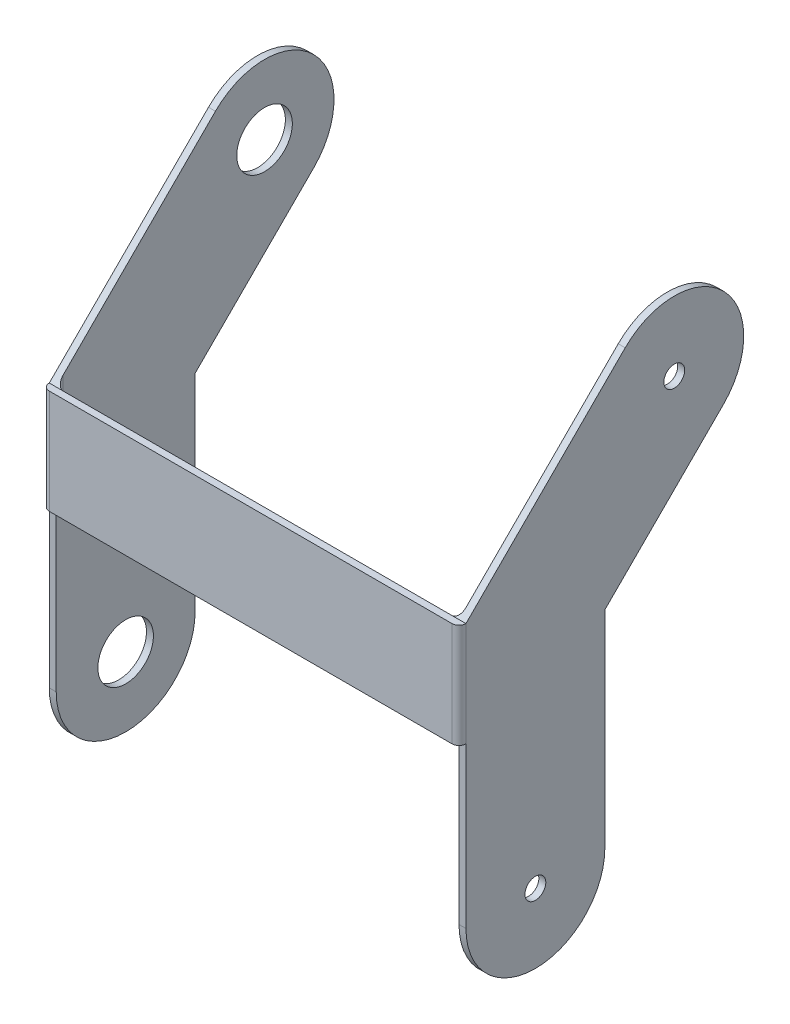
ISO-10303-21;
HEADER;
FILE_DESCRIPTION(('STEP AP214'),'2;1');
FILE_NAME('part.step','',(''),(''),'','','');
FILE_SCHEMA(('AUTOMOTIVE_DESIGN { 1 0 10303 214 1 1 1 1 }'));
ENDSEC;
DATA;
#1=APPLICATION_CONTEXT('core data for automotive mechanical design processes');
#2=APPLICATION_PROTOCOL_DEFINITION('international standard','automotive_design',2000,#1);
#3=PRODUCT_CONTEXT('',#1,'mechanical');
#4=PRODUCT('Part','Part','',(#3));
#5=PRODUCT_RELATED_PRODUCT_CATEGORY('part','',(#4));
#6=PRODUCT_DEFINITION_FORMATION('','',#4);
#7=PRODUCT_DEFINITION_CONTEXT('part definition',#1,'design');
#8=PRODUCT_DEFINITION('design','',#6,#7);
#9=PRODUCT_DEFINITION_SHAPE('','',#8);
#10=(LENGTH_UNIT() NAMED_UNIT(*) SI_UNIT(.MILLI.,.METRE.));
#11=(NAMED_UNIT(*) PLANE_ANGLE_UNIT() SI_UNIT($,.RADIAN.));
#12=(NAMED_UNIT(*) SI_UNIT($,.STERADIAN.) SOLID_ANGLE_UNIT());
#13=UNCERTAINTY_MEASURE_WITH_UNIT(LENGTH_MEASURE(1.E-05),#10,'distance_accuracy_value','');
#14=(GEOMETRIC_REPRESENTATION_CONTEXT(3) GLOBAL_UNCERTAINTY_ASSIGNED_CONTEXT((#13)) GLOBAL_UNIT_ASSIGNED_CONTEXT((#10,
#11,#12)) REPRESENTATION_CONTEXT('',''));
#15=CARTESIAN_POINT('',(0.,0.,0.));
#16=DIRECTION('',(0.,0.,1.));
#17=DIRECTION('',(1.,0.,0.));
#18=AXIS2_PLACEMENT_3D('',#15,#16,#17);
#19=CARTESIAN_POINT('',(1.,-38.019,0.));
#20=DIRECTION('',(0.,0.,-1.));
#21=DIRECTION('',(-1.,0.,0.));
#22=AXIS2_PLACEMENT_3D('',#19,#20,#21);
#23=PLANE('',#22);
#24=DIRECTION('',(-1.,0.,0.));
#25=VECTOR('',#24,1.);
#26=CARTESIAN_POINT('',(30.,-15.,0.));
#27=LINE('',#26,#25);
#28=CARTESIAN_POINT('',(1.,-15.,0.));
#29=VERTEX_POINT('',#28);
#30=CARTESIAN_POINT('',(0.,-15.,0.));
#31=VERTEX_POINT('',#30);
#32=EDGE_CURVE('E165',#29,#31,#27,.T.);
#33=ORIENTED_EDGE('',*,*,#32,.T.);
#34=DIRECTION('',(0.,-1.,0.));
#35=VECTOR('',#34,1.);
#36=CARTESIAN_POINT('',(0.,-38.019,0.));
#37=LINE('',#36,#35);
#38=CARTESIAN_POINT('',(0.,-38.019,0.));
#39=VERTEX_POINT('',#38);
#40=EDGE_CURVE('E176',#31,#39,#37,.T.);
#41=ORIENTED_EDGE('',*,*,#40,.T.);
#42=DIRECTION('',(-1.,0.,0.));
#43=VECTOR('',#42,1.);
#44=CARTESIAN_POINT('',(1.,-38.019,0.));
#45=LINE('',#44,#43);
#46=CARTESIAN_POINT('',(1.,-38.019,0.));
#47=VERTEX_POINT('',#46);
#48=EDGE_CURVE('E235',#47,#39,#45,.T.);
#49=ORIENTED_EDGE('',*,*,#48,.F.);
#50=DIRECTION('',(0.,-1.,0.));
#51=VECTOR('',#50,1.);
#52=CARTESIAN_POINT('',(1.,-38.019,0.));
#53=LINE('',#52,#51);
#54=EDGE_CURVE('E179',#29,#47,#53,.T.);
#55=ORIENTED_EDGE('',*,*,#54,.F.);
#56=EDGE_LOOP('',(#33,#41,#49,#55));
#57=FACE_BOUND('',#56,.T.);
#58=ADVANCED_FACE('F32',(#57),#23,.F.);
#59=CARTESIAN_POINT('',(1.,15.8575766748895,-29.9997122986205));
#60=DIRECTION('',(-1.,0.,0.));
#61=DIRECTION('',(0.,0.,1.));
#62=AXIS2_PLACEMENT_3D('',#59,#60,#61);
#63=PLANE('',#62);
#64=CARTESIAN_POINT('',(1.,-38.019,-10.));
#65=DIRECTION('',(-1.,0.,0.));
#66=DIRECTION('',(0.,0.,1.));
#67=AXIS2_PLACEMENT_3D('',#64,#65,#66);
#68=CIRCLE('',#67,4.);
#69=CARTESIAN_POINT('',(1.,-38.019,-6.));
#70=VERTEX_POINT('',#69);
#71=EDGE_CURVE('E346',#70,#70,#68,.F.);
#72=ORIENTED_EDGE('',*,*,#71,.F.);
#73=EDGE_LOOP('',(#72));
#74=FACE_BOUND('',#73,.T.);
#75=CARTESIAN_POINT('',(1.,15.8575766748895,-29.9997122986205));
#76=DIRECTION('',(-1.,0.,0.));
#77=DIRECTION('',(0.,0.,1.));
#78=AXIS2_PLACEMENT_3D('',#75,#76,#77);
#79=CIRCLE('',#78,4.);
#80=CARTESIAN_POINT('',(1.,15.8575766748895,-25.9997122986205));
#81=VERTEX_POINT('',#80);
#82=EDGE_CURVE('E340',#81,#81,#79,.F.);
#83=ORIENTED_EDGE('',*,*,#82,.F.);
#84=EDGE_LOOP('',(#83));
#85=FACE_BOUND('',#84,.T.);
#86=DIRECTION('',(0.,-0.707106781186546,0.707106781186549));
#87=VECTOR('',#86,1.);
#88=CARTESIAN_POINT('',(1.,0.,0.));
#89=LINE('',#88,#87);
#90=CARTESIAN_POINT('',(1.,22.928644486755,-22.928644486755));
#91=VERTEX_POINT('',#90);
#92=CARTESIAN_POINT('',(1.,0.999999999999997,-0.999999999999999));
#93=VERTEX_POINT('',#92);
#94=EDGE_CURVE('E240',#91,#93,#89,.T.);
#95=ORIENTED_EDGE('',*,*,#94,.T.);
#96=DIRECTION('',(0.,-1.,0.));
#97=VECTOR('',#96,1.);
#98=CARTESIAN_POINT('',(1.,-15.,-1.));
#99=LINE('',#98,#97);
#100=CARTESIAN_POINT('',(1.,-15.,-1.));
#101=VERTEX_POINT('',#100);
#102=EDGE_CURVE('E232',#93,#101,#99,.T.);
#103=ORIENTED_EDGE('',*,*,#102,.T.);
#104=DIRECTION('',(0.,0.,1.));
#105=VECTOR('',#104,1.);
#106=CARTESIAN_POINT('',(1.,-15.,0.));
#107=LINE('',#106,#105);
#108=EDGE_CURVE('E233',#101,#29,#107,.T.);
#109=ORIENTED_EDGE('',*,*,#108,.T.);
#110=ORIENTED_EDGE('',*,*,#54,.T.);
#111=CARTESIAN_POINT('',(1.,-38.019,-10.));
#112=DIRECTION('',(1.,0.,0.));
#113=DIRECTION('',(0.,0.,1.));
#114=AXIS2_PLACEMENT_3D('',#111,#112,#113);
#115=CIRCLE('',#114,10.);
#116=CARTESIAN_POINT('',(1.,-38.019,-20.));
#117=VERTEX_POINT('',#116);
#118=EDGE_CURVE('E273',#47,#117,#115,.T.);
#119=ORIENTED_EDGE('',*,*,#118,.T.);
#120=DIRECTION('',(0.,1.,0.));
#121=VECTOR('',#120,1.);
#122=CARTESIAN_POINT('',(1.,-8.28427124746194,-20.));
#123=LINE('',#122,#121);
#124=CARTESIAN_POINT('',(1.,-8.28427124746194,-20.));
#125=VERTEX_POINT('',#124);
#126=EDGE_CURVE('E271',#117,#125,#123,.T.);
#127=ORIENTED_EDGE('',*,*,#126,.T.);
#128=DIRECTION('',(0.,0.707106781186546,-0.707106781186549));
#129=VECTOR('',#128,1.);
#130=CARTESIAN_POINT('',(1.,8.78650886302398,-37.070780110486));
#131=LINE('',#130,#129);
#132=CARTESIAN_POINT('',(1.,8.78650886302399,-37.070780110486));
#133=VERTEX_POINT('',#132);
#134=EDGE_CURVE('E269',#125,#133,#131,.T.);
#135=ORIENTED_EDGE('',*,*,#134,.T.);
#136=CARTESIAN_POINT('',(1.,15.8575766748895,-29.9997122986205));
#137=DIRECTION('',(1.,0.,0.));
#138=DIRECTION('',(0.,0.,1.));
#139=AXIS2_PLACEMENT_3D('',#136,#137,#138);
#140=CIRCLE('',#139,10.);
#141=EDGE_CURVE('E267',#133,#91,#140,.T.);
#142=ORIENTED_EDGE('',*,*,#141,.T.);
#143=EDGE_LOOP('',(#95,#103,#109,#110,#119,#127,#135,#142));
#144=FACE_BOUND('',#143,.T.);
#145=ADVANCED_FACE('F238',(#74,#85,#144),#63,.F.);
#146=CARTESIAN_POINT('',(0.,15.8575766748895,-29.9997122986205));
#147=DIRECTION('',(-1.,0.,0.));
#148=DIRECTION('',(0.,0.,1.));
#149=AXIS2_PLACEMENT_3D('',#146,#147,#148);
#150=PLANE('',#149);
#151=CARTESIAN_POINT('',(0.,-38.019,-10.));
#152=DIRECTION('',(-1.,0.,0.));
#153=DIRECTION('',(0.,0.,1.));
#154=AXIS2_PLACEMENT_3D('',#151,#152,#153);
#155=CIRCLE('',#154,4.);
#156=CARTESIAN_POINT('',(0.,-38.019,-6.));
#157=VERTEX_POINT('',#156);
#158=EDGE_CURVE('E349',#157,#157,#155,.T.);
#159=ORIENTED_EDGE('',*,*,#158,.F.);
#160=EDGE_LOOP('',(#159));
#161=FACE_BOUND('',#160,.T.);
#162=CARTESIAN_POINT('',(0.,15.8575766748895,-29.9997122986205));
#163=DIRECTION('',(-1.,0.,0.));
#164=DIRECTION('',(0.,0.,1.));
#165=AXIS2_PLACEMENT_3D('',#162,#163,#164);
#166=CIRCLE('',#165,4.);
#167=CARTESIAN_POINT('',(0.,15.8575766748895,-25.9997122986205));
#168=VERTEX_POINT('',#167);
#169=EDGE_CURVE('E343',#168,#168,#166,.T.);
#170=ORIENTED_EDGE('',*,*,#169,.F.);
#171=EDGE_LOOP('',(#170));
#172=FACE_BOUND('',#171,.T.);
#173=ORIENTED_EDGE('',*,*,#40,.F.);
#174=DIRECTION('',(0.,-1.,0.));
#175=VECTOR('',#174,1.);
#176=CARTESIAN_POINT('',(0.,0.,0.));
#177=LINE('',#176,#175);
#178=CARTESIAN_POINT('',(0.,0.,0.));
#179=VERTEX_POINT('',#178);
#180=EDGE_CURVE('E122',#31,#179,#177,.F.);
#181=ORIENTED_EDGE('',*,*,#180,.T.);
#182=DIRECTION('',(0.,-0.707106781186546,0.707106781186549));
#183=VECTOR('',#182,1.);
#184=CARTESIAN_POINT('',(0.,0.,0.));
#185=LINE('',#184,#183);
#186=CARTESIAN_POINT('',(0.,22.928644486755,-22.928644486755));
#187=VERTEX_POINT('',#186);
#188=EDGE_CURVE('E257',#187,#179,#185,.T.);
#189=ORIENTED_EDGE('',*,*,#188,.F.);
#190=CARTESIAN_POINT('',(0.,15.8575766748895,-29.9997122986205));
#191=DIRECTION('',(1.,0.,0.));
#192=DIRECTION('',(0.,0.,1.));
#193=AXIS2_PLACEMENT_3D('',#190,#191,#192);
#194=CIRCLE('',#193,10.);
#195=CARTESIAN_POINT('',(0.,8.78650886302399,-37.070780110486));
#196=VERTEX_POINT('',#195);
#197=EDGE_CURVE('E259',#196,#187,#194,.T.);
#198=ORIENTED_EDGE('',*,*,#197,.F.);
#199=DIRECTION('',(0.,0.707106781186546,-0.707106781186549));
#200=VECTOR('',#199,1.);
#201=CARTESIAN_POINT('',(0.,8.78650886302398,-37.070780110486));
#202=LINE('',#201,#200);
#203=CARTESIAN_POINT('',(0.,-8.28427124746194,-20.));
#204=VERTEX_POINT('',#203);
#205=EDGE_CURVE('E261',#204,#196,#202,.T.);
#206=ORIENTED_EDGE('',*,*,#205,.F.);
#207=DIRECTION('',(0.,1.,0.));
#208=VECTOR('',#207,1.);
#209=CARTESIAN_POINT('',(0.,-8.28427124746194,-20.));
#210=LINE('',#209,#208);
#211=CARTESIAN_POINT('',(0.,-38.019,-20.));
#212=VERTEX_POINT('',#211);
#213=EDGE_CURVE('E263',#212,#204,#210,.T.);
#214=ORIENTED_EDGE('',*,*,#213,.F.);
#215=CARTESIAN_POINT('',(0.,-38.019,-10.));
#216=DIRECTION('',(1.,0.,0.));
#217=DIRECTION('',(0.,0.,1.));
#218=AXIS2_PLACEMENT_3D('',#215,#216,#217);
#219=CIRCLE('',#218,10.);
#220=EDGE_CURVE('E188',#39,#212,#219,.T.);
#221=ORIENTED_EDGE('',*,*,#220,.F.);
#222=EDGE_LOOP('',(#173,#181,#189,#198,#206,#214,#221));
#223=FACE_BOUND('',#222,.T.);
#224=ADVANCED_FACE('F183',(#161,#172,#223),#150,.T.);
#225=CARTESIAN_POINT('',(1.,-38.019,-10.));
#226=DIRECTION('',(-1.,0.,0.));
#227=DIRECTION('',(0.,0.,1.));
#228=AXIS2_PLACEMENT_3D('',#225,#226,#227);
#229=CYLINDRICAL_SURFACE('',#228,10.);
#230=ORIENTED_EDGE('',*,*,#220,.T.);
#231=DIRECTION('',(-1.,0.,0.));
#232=VECTOR('',#231,1.);
#233=CARTESIAN_POINT('',(1.,-38.019,-20.));
#234=LINE('',#233,#232);
#235=EDGE_CURVE('E244',#117,#212,#234,.T.);
#236=ORIENTED_EDGE('',*,*,#235,.F.);
#237=ORIENTED_EDGE('',*,*,#118,.F.);
#238=ORIENTED_EDGE('',*,*,#48,.T.);
#239=EDGE_LOOP('',(#230,#236,#237,#238));
#240=FACE_BOUND('',#239,.T.);
#241=ADVANCED_FACE('F358',(#240),#229,.T.);
#242=CARTESIAN_POINT('',(1.,-8.28427124746194,-20.));
#243=DIRECTION('',(0.,0.,1.));
#244=DIRECTION('',(1.,0.,0.));
#245=AXIS2_PLACEMENT_3D('',#242,#243,#244);
#246=PLANE('',#245);
#247=ORIENTED_EDGE('',*,*,#213,.T.);
#248=DIRECTION('',(-1.,0.,0.));
#249=VECTOR('',#248,1.);
#250=CARTESIAN_POINT('',(1.,-8.28427124746194,-20.));
#251=LINE('',#250,#249);
#252=EDGE_CURVE('E247',#125,#204,#251,.T.);
#253=ORIENTED_EDGE('',*,*,#252,.F.);
#254=ORIENTED_EDGE('',*,*,#126,.F.);
#255=ORIENTED_EDGE('',*,*,#235,.T.);
#256=EDGE_LOOP('',(#247,#253,#254,#255));
#257=FACE_BOUND('',#256,.T.);
#258=ADVANCED_FACE('F390',(#257),#246,.F.);
#259=CARTESIAN_POINT('',(1.,8.78650886302398,-37.070780110486));
#260=DIRECTION('',(0.,0.707106781186549,0.707106781186546));
#261=DIRECTION('',(0.,-0.707106781186546,0.707106781186549));
#262=AXIS2_PLACEMENT_3D('',#259,#260,#261);
#263=PLANE('',#262);
#264=ORIENTED_EDGE('',*,*,#205,.T.);
#265=DIRECTION('',(-1.,0.,0.));
#266=VECTOR('',#265,1.);
#267=CARTESIAN_POINT('',(1.,8.78650886302399,-37.070780110486));
#268=LINE('',#267,#266);
#269=EDGE_CURVE('E250',#133,#196,#268,.T.);
#270=ORIENTED_EDGE('',*,*,#269,.F.);
#271=ORIENTED_EDGE('',*,*,#134,.F.);
#272=ORIENTED_EDGE('',*,*,#252,.T.);
#273=EDGE_LOOP('',(#264,#270,#271,#272));
#274=FACE_BOUND('',#273,.T.);
#275=ADVANCED_FACE('F386',(#274),#263,.F.);
#276=CARTESIAN_POINT('',(1.,15.8575766748895,-29.9997122986205));
#277=DIRECTION('',(-1.,0.,0.));
#278=DIRECTION('',(0.,0.,1.));
#279=AXIS2_PLACEMENT_3D('',#276,#277,#278);
#280=CYLINDRICAL_SURFACE('',#279,10.);
#281=ORIENTED_EDGE('',*,*,#197,.T.);
#282=DIRECTION('',(-1.,0.,0.));
#283=VECTOR('',#282,1.);
#284=CARTESIAN_POINT('',(1.,22.928644486755,-22.928644486755));
#285=LINE('',#284,#283);
#286=EDGE_CURVE('E253',#91,#187,#285,.T.);
#287=ORIENTED_EDGE('',*,*,#286,.F.);
#288=ORIENTED_EDGE('',*,*,#141,.F.);
#289=ORIENTED_EDGE('',*,*,#269,.T.);
#290=EDGE_LOOP('',(#281,#287,#288,#289));
#291=FACE_BOUND('',#290,.T.);
#292=ADVANCED_FACE('F383',(#291),#280,.T.);
#293=CARTESIAN_POINT('',(1.,0.,0.));
#294=DIRECTION('',(0.,-0.707106781186549,-0.707106781186546));
#295=DIRECTION('',(0.,0.707106781186546,-0.707106781186549));
#296=AXIS2_PLACEMENT_3D('',#293,#294,#295);
#297=PLANE('',#296);
#298=ORIENTED_EDGE('',*,*,#188,.T.);
#299=DIRECTION('',(-1.,0.,0.));
#300=VECTOR('',#299,1.);
#301=CARTESIAN_POINT('',(1.,0.,0.));
#302=LINE('',#301,#300);
#303=CARTESIAN_POINT('',(2.,0.,0.));
#304=VERTEX_POINT('',#303);
#305=EDGE_CURVE('E70',#304,#179,#302,.T.);
#306=ORIENTED_EDGE('',*,*,#305,.F.);
#307=CARTESIAN_POINT('',(2.,0.999999999999997,-0.999999999999999));
#308=DIRECTION('',(0.,-0.707106781186549,-0.707106781186546));
#309=DIRECTION('',(0.,0.707106781186546,-0.707106781186549));
#310=AXIS2_PLACEMENT_3D('',#307,#308,#309);
#311=ELLIPSE('',#310,1.41421356237309,1.);
#312=EDGE_CURVE('E132',#304,#93,#311,.T.);
#313=ORIENTED_EDGE('',*,*,#312,.T.);
#314=ORIENTED_EDGE('',*,*,#94,.F.);
#315=ORIENTED_EDGE('',*,*,#286,.T.);
#316=EDGE_LOOP('',(#298,#306,#313,#314,#315));
#317=FACE_BOUND('',#316,.T.);
#318=ADVANCED_FACE('F380',(#317),#297,.F.);
#319=CARTESIAN_POINT('',(30.,0.,0.));
#320=DIRECTION('',(0.,0.,1.));
#321=DIRECTION('',(0.,-1.,0.));
#322=AXIS2_PLACEMENT_3D('',#319,#320,#321);
#323=PLANE('',#322);
#324=CARTESIAN_POINT('',(58.,-15.,0.));
#325=VERTEX_POINT('',#324);
#326=CARTESIAN_POINT('',(2.,-15.,0.));
#327=VERTEX_POINT('',#326);
#328=EDGE_CURVE('E134',#325,#327,#27,.T.);
#329=ORIENTED_EDGE('',*,*,#328,.T.);
#330=DIRECTION('',(0.,-1.,0.));
#331=VECTOR('',#330,1.);
#332=CARTESIAN_POINT('',(2.,0.,0.));
#333=LINE('',#332,#331);
#334=EDGE_CURVE('E152',#327,#304,#333,.F.);
#335=ORIENTED_EDGE('',*,*,#334,.T.);
#336=DIRECTION('',(-1.,0.,0.));
#337=VECTOR('',#336,1.);
#338=CARTESIAN_POINT('',(30.,0.,0.));
#339=LINE('',#338,#337);
#340=CARTESIAN_POINT('',(58.,0.,0.));
#341=VERTEX_POINT('',#340);
#342=EDGE_CURVE('E117',#341,#304,#339,.T.);
#343=ORIENTED_EDGE('',*,*,#342,.F.);
#344=DIRECTION('',(0.,-1.,0.));
#345=VECTOR('',#344,1.);
#346=CARTESIAN_POINT('',(58.,-15.,0.));
#347=LINE('',#346,#345);
#348=EDGE_CURVE('E154',#341,#325,#347,.T.);
#349=ORIENTED_EDGE('',*,*,#348,.T.);
#350=EDGE_LOOP('',(#329,#335,#343,#349));
#351=FACE_BOUND('',#350,.T.);
#352=ADVANCED_FACE('F377',(#351),#323,.F.);
#353=CARTESIAN_POINT('',(30.,0.,0.));
#354=DIRECTION('',(0.,-1.,0.));
#355=DIRECTION('',(0.,0.,-1.));
#356=AXIS2_PLACEMENT_3D('',#353,#354,#355);
#357=PLANE('',#356);
#358=ORIENTED_EDGE('',*,*,#305,.T.);
#359=CARTESIAN_POINT('',(1.,0.,0.));
#360=DIRECTION('',(0.,-1.,0.));
#361=DIRECTION('',(0.,0.,-1.));
#362=AXIS2_PLACEMENT_3D('',#359,#360,#361);
#363=CIRCLE('',#362,1.);
#364=CARTESIAN_POINT('',(1.,0.,1.));
#365=VERTEX_POINT('',#364);
#366=EDGE_CURVE('E116',#179,#365,#363,.F.);
#367=ORIENTED_EDGE('',*,*,#366,.T.);
#368=DIRECTION('',(-1.,0.,0.));
#369=VECTOR('',#368,1.);
#370=CARTESIAN_POINT('',(30.,0.,1.));
#371=LINE('',#370,#369);
#372=CARTESIAN_POINT('',(59.,0.,1.));
#373=VERTEX_POINT('',#372);
#374=EDGE_CURVE('E103',#373,#365,#371,.T.);
#375=ORIENTED_EDGE('',*,*,#374,.F.);
#376=CARTESIAN_POINT('',(59.,0.,0.));
#377=DIRECTION('',(0.,-1.,0.));
#378=DIRECTION('',(0.,0.,-1.));
#379=AXIS2_PLACEMENT_3D('',#376,#377,#378);
#380=CIRCLE('',#379,1.);
#381=CARTESIAN_POINT('',(60.,0.,0.));
#382=VERTEX_POINT('',#381);
#383=EDGE_CURVE('E114',#373,#382,#380,.F.);
#384=ORIENTED_EDGE('',*,*,#383,.T.);
#385=DIRECTION('',(1.,0.,0.));
#386=VECTOR('',#385,1.);
#387=CARTESIAN_POINT('',(59.,0.,0.));
#388=LINE('',#387,#386);
#389=EDGE_CURVE('E47',#341,#382,#388,.T.);
#390=ORIENTED_EDGE('',*,*,#389,.F.);
#391=ORIENTED_EDGE('',*,*,#342,.T.);
#392=EDGE_LOOP('',(#358,#367,#375,#384,#390,#391));
#393=FACE_BOUND('',#392,.T.);
#394=ADVANCED_FACE('F112',(#393),#357,.F.);
#395=CARTESIAN_POINT('',(30.,0.,1.));
#396=DIRECTION('',(0.,0.,-1.));
#397=DIRECTION('',(0.,1.,0.));
#398=AXIS2_PLACEMENT_3D('',#395,#396,#397);
#399=PLANE('',#398);
#400=ORIENTED_EDGE('',*,*,#374,.T.);
#401=DIRECTION('',(0.,-1.,0.));
#402=VECTOR('',#401,1.);
#403=CARTESIAN_POINT('',(1.,-15.,0.999999999999998));
#404=LINE('',#403,#402);
#405=CARTESIAN_POINT('',(1.,-15.,0.999999999999998));
#406=VERTEX_POINT('',#405);
#407=EDGE_CURVE('E110',#365,#406,#404,.T.);
#408=ORIENTED_EDGE('',*,*,#407,.T.);
#409=DIRECTION('',(-1.,0.,0.));
#410=VECTOR('',#409,1.);
#411=CARTESIAN_POINT('',(30.,-15.,0.999999999999998));
#412=LINE('',#411,#410);
#413=CARTESIAN_POINT('',(59.,-15.,0.999999999999998));
#414=VERTEX_POINT('',#413);
#415=EDGE_CURVE('E106',#414,#406,#412,.T.);
#416=ORIENTED_EDGE('',*,*,#415,.F.);
#417=DIRECTION('',(0.,-1.,0.));
#418=VECTOR('',#417,1.);
#419=CARTESIAN_POINT('',(59.,0.,1.));
#420=LINE('',#419,#418);
#421=EDGE_CURVE('E99',#414,#373,#420,.F.);
#422=ORIENTED_EDGE('',*,*,#421,.T.);
#423=EDGE_LOOP('',(#400,#408,#416,#422));
#424=FACE_BOUND('',#423,.T.);
#425=ADVANCED_FACE('F101',(#424),#399,.F.);
#426=CARTESIAN_POINT('',(30.,-15.,0.));
#427=DIRECTION('',(0.,1.,0.));
#428=DIRECTION('',(0.,0.,1.));
#429=AXIS2_PLACEMENT_3D('',#426,#427,#428);
#430=PLANE('',#429);
#431=ORIENTED_EDGE('',*,*,#415,.T.);
#432=CARTESIAN_POINT('',(1.,-15.,0.));
#433=DIRECTION('',(0.,1.,0.));
#434=DIRECTION('',(0.,0.,1.));
#435=AXIS2_PLACEMENT_3D('',#432,#433,#434);
#436=CIRCLE('',#435,1.);
#437=EDGE_CURVE('E126',#406,#31,#436,.F.);
#438=ORIENTED_EDGE('',*,*,#437,.T.);
#439=ORIENTED_EDGE('',*,*,#32,.F.);
#440=ORIENTED_EDGE('',*,*,#108,.F.);
#441=CARTESIAN_POINT('',(2.,-15.,-1.));
#442=DIRECTION('',(0.,1.,0.));
#443=DIRECTION('',(0.,0.,1.));
#444=AXIS2_PLACEMENT_3D('',#441,#442,#443);
#445=CIRCLE('',#444,1.);
#446=EDGE_CURVE('E81',#101,#327,#445,.T.);
#447=ORIENTED_EDGE('',*,*,#446,.T.);
#448=ORIENTED_EDGE('',*,*,#328,.F.);
#449=CARTESIAN_POINT('',(58.,-15.,-1.));
#450=DIRECTION('',(0.,1.,0.));
#451=DIRECTION('',(0.,0.,1.));
#452=AXIS2_PLACEMENT_3D('',#449,#450,#451);
#453=CIRCLE('',#452,1.);
#454=CARTESIAN_POINT('',(59.,-15.,-1.));
#455=VERTEX_POINT('',#454);
#456=EDGE_CURVE('E40',#325,#455,#453,.T.);
#457=ORIENTED_EDGE('',*,*,#456,.T.);
#458=DIRECTION('',(0.,0.,-1.));
#459=VECTOR('',#458,1.);
#460=CARTESIAN_POINT('',(59.,-15.,0.));
#461=LINE('',#460,#459);
#462=CARTESIAN_POINT('',(59.,-15.,0.));
#463=VERTEX_POINT('',#462);
#464=EDGE_CURVE('E56',#463,#455,#461,.T.);
#465=ORIENTED_EDGE('',*,*,#464,.F.);
#466=DIRECTION('',(1.,0.,0.));
#467=VECTOR('',#466,1.);
#468=CARTESIAN_POINT('',(30.,-15.,0.));
#469=LINE('',#468,#467);
#470=CARTESIAN_POINT('',(60.,-15.,0.));
#471=VERTEX_POINT('',#470);
#472=EDGE_CURVE('E336',#463,#471,#469,.T.);
#473=ORIENTED_EDGE('',*,*,#472,.T.);
#474=CARTESIAN_POINT('',(59.,-15.,0.));
#475=DIRECTION('',(0.,1.,0.));
#476=DIRECTION('',(0.,0.,1.));
#477=AXIS2_PLACEMENT_3D('',#474,#475,#476);
#478=CIRCLE('',#477,1.);
#479=EDGE_CURVE('E159',#471,#414,#478,.F.);
#480=ORIENTED_EDGE('',*,*,#479,.T.);
#481=EDGE_LOOP('',(#431,#438,#439,#440,#447,#448,#457,#465,#473,#480));
#482=FACE_BOUND('',#481,.T.);
#483=ADVANCED_FACE('F133',(#482),#430,.F.);
#484=CARTESIAN_POINT('',(59.,-38.019,0.));
#485=DIRECTION('',(0.,0.,-1.));
#486=DIRECTION('',(1.,0.,0.));
#487=AXIS2_PLACEMENT_3D('',#484,#485,#486);
#488=PLANE('',#487);
#489=ORIENTED_EDGE('',*,*,#472,.F.);
#490=DIRECTION('',(0.,-1.,0.));
#491=VECTOR('',#490,1.);
#492=CARTESIAN_POINT('',(59.,-38.019,0.));
#493=LINE('',#492,#491);
#494=CARTESIAN_POINT('',(59.,-38.019,0.));
#495=VERTEX_POINT('',#494);
#496=EDGE_CURVE('E147',#463,#495,#493,.T.);
#497=ORIENTED_EDGE('',*,*,#496,.T.);
#498=DIRECTION('',(1.,0.,0.));
#499=VECTOR('',#498,1.);
#500=CARTESIAN_POINT('',(59.,-38.019,0.));
#501=LINE('',#500,#499);
#502=CARTESIAN_POINT('',(60.,-38.019,0.));
#503=VERTEX_POINT('',#502);
#504=EDGE_CURVE('E180',#495,#503,#501,.T.);
#505=ORIENTED_EDGE('',*,*,#504,.T.);
#506=DIRECTION('',(0.,-1.,0.));
#507=VECTOR('',#506,1.);
#508=CARTESIAN_POINT('',(60.,-38.019,0.));
#509=LINE('',#508,#507);
#510=EDGE_CURVE('E309',#471,#503,#509,.T.);
#511=ORIENTED_EDGE('',*,*,#510,.F.);
#512=EDGE_LOOP('',(#489,#497,#505,#511));
#513=FACE_BOUND('',#512,.T.);
#514=ADVANCED_FACE('F523',(#513),#488,.F.);
#515=CARTESIAN_POINT('',(59.,15.8575766748895,-29.9997122986205));
#516=DIRECTION('',(1.,0.,0.));
#517=DIRECTION('',(0.,0.,1.));
#518=AXIS2_PLACEMENT_3D('',#515,#516,#517);
#519=PLANE('',#518);
#520=CARTESIAN_POINT('',(59.,15.8575766748895,-29.9997122986205));
#521=DIRECTION('',(1.,0.,0.));
#522=DIRECTION('',(0.,0.,-1.));
#523=AXIS2_PLACEMENT_3D('',#520,#521,#522);
#524=CIRCLE('',#523,1.5);
#525=CARTESIAN_POINT('',(59.,15.8575766748895,-31.4997122986205));
#526=VERTEX_POINT('',#525);
#527=EDGE_CURVE('E312',#526,#526,#524,.T.);
#528=ORIENTED_EDGE('',*,*,#527,.T.);
#529=EDGE_LOOP('',(#528));
#530=FACE_BOUND('',#529,.T.);
#531=ORIENTED_EDGE('',*,*,#496,.F.);
#532=ORIENTED_EDGE('',*,*,#464,.T.);
#533=DIRECTION('',(0.,-1.,0.));
#534=VECTOR('',#533,1.);
#535=CARTESIAN_POINT('',(59.,0.,-1.));
#536=LINE('',#535,#534);
#537=CARTESIAN_POINT('',(59.,0.999999999999997,-1.));
#538=VERTEX_POINT('',#537);
#539=EDGE_CURVE('E143',#455,#538,#536,.F.);
#540=ORIENTED_EDGE('',*,*,#539,.T.);
#541=DIRECTION('',(0.,-0.707106781186546,0.707106781186549));
#542=VECTOR('',#541,1.);
#543=CARTESIAN_POINT('',(59.,0.,0.));
#544=LINE('',#543,#542);
#545=CARTESIAN_POINT('',(59.,22.928644486755,-22.928644486755));
#546=VERTEX_POINT('',#545);
#547=EDGE_CURVE('E293',#546,#538,#544,.T.);
#548=ORIENTED_EDGE('',*,*,#547,.F.);
#549=CARTESIAN_POINT('',(59.,15.8575766748895,-29.9997122986205));
#550=DIRECTION('',(1.,0.,0.));
#551=DIRECTION('',(0.,0.,1.));
#552=AXIS2_PLACEMENT_3D('',#549,#550,#551);
#553=CIRCLE('',#552,10.);
#554=CARTESIAN_POINT('',(59.,8.78650886302399,-37.070780110486));
#555=VERTEX_POINT('',#554);
#556=EDGE_CURVE('E314',#555,#546,#553,.T.);
#557=ORIENTED_EDGE('',*,*,#556,.F.);
#558=DIRECTION('',(0.,0.707106781186546,-0.707106781186549));
#559=VECTOR('',#558,1.);
#560=CARTESIAN_POINT('',(59.,8.78650886302398,-37.070780110486));
#561=LINE('',#560,#559);
#562=CARTESIAN_POINT('',(59.,-8.28427124746194,-20.));
#563=VERTEX_POINT('',#562);
#564=EDGE_CURVE('E317',#563,#555,#561,.T.);
#565=ORIENTED_EDGE('',*,*,#564,.F.);
#566=DIRECTION('',(0.,1.,0.));
#567=VECTOR('',#566,1.);
#568=CARTESIAN_POINT('',(59.,-8.28427124746194,-20.));
#569=LINE('',#568,#567);
#570=CARTESIAN_POINT('',(59.,-38.019,-20.));
#571=VERTEX_POINT('',#570);
#572=EDGE_CURVE('E320',#571,#563,#569,.T.);
#573=ORIENTED_EDGE('',*,*,#572,.F.);
#574=CARTESIAN_POINT('',(59.,-38.019,-10.));
#575=DIRECTION('',(1.,0.,0.));
#576=DIRECTION('',(0.,0.,1.));
#577=AXIS2_PLACEMENT_3D('',#574,#575,#576);
#578=CIRCLE('',#577,10.);
#579=EDGE_CURVE('E323',#495,#571,#578,.T.);
#580=ORIENTED_EDGE('',*,*,#579,.F.);
#581=EDGE_LOOP('',(#531,#532,#540,#548,#557,#565,#573,#580));
#582=FACE_BOUND('',#581,.T.);
#583=CARTESIAN_POINT('',(59.,-38.019,-10.));
#584=DIRECTION('',(1.,0.,0.));
#585=DIRECTION('',(0.,0.,-1.));
#586=AXIS2_PLACEMENT_3D('',#583,#584,#585);
#587=CIRCLE('',#586,1.5);
#588=CARTESIAN_POINT('',(59.,-38.019,-11.5));
#589=VERTEX_POINT('',#588);
#590=EDGE_CURVE('E330',#589,#589,#587,.T.);
#591=ORIENTED_EDGE('',*,*,#590,.T.);
#592=EDGE_LOOP('',(#591));
#593=FACE_BOUND('',#592,.T.);
#594=ADVANCED_FACE('F140',(#530,#582,#593),#519,.F.);
#595=CARTESIAN_POINT('',(60.,15.8575766748895,-29.9997122986205));
#596=DIRECTION('',(1.,0.,0.));
#597=DIRECTION('',(0.,0.,1.));
#598=AXIS2_PLACEMENT_3D('',#595,#596,#597);
#599=PLANE('',#598);
#600=CARTESIAN_POINT('',(60.,15.8575766748895,-29.9997122986205));
#601=DIRECTION('',(1.,0.,0.));
#602=DIRECTION('',(0.,0.,-1.));
#603=AXIS2_PLACEMENT_3D('',#600,#601,#602);
#604=CIRCLE('',#603,1.5);
#605=CARTESIAN_POINT('',(60.,15.8575766748895,-31.4997122986205));
#606=VERTEX_POINT('',#605);
#607=EDGE_CURVE('E327',#606,#606,#604,.T.);
#608=ORIENTED_EDGE('',*,*,#607,.F.);
#609=EDGE_LOOP('',(#608));
#610=FACE_BOUND('',#609,.T.);
#611=DIRECTION('',(0.,-0.707106781186546,0.707106781186549));
#612=VECTOR('',#611,1.);
#613=CARTESIAN_POINT('',(60.,0.,0.));
#614=LINE('',#613,#612);
#615=CARTESIAN_POINT('',(60.,22.928644486755,-22.928644486755));
#616=VERTEX_POINT('',#615);
#617=EDGE_CURVE('E294',#616,#382,#614,.T.);
#618=ORIENTED_EDGE('',*,*,#617,.T.);
#619=DIRECTION('',(0.,-1.,0.));
#620=VECTOR('',#619,1.);
#621=CARTESIAN_POINT('',(60.,-15.,0.));
#622=LINE('',#621,#620);
#623=EDGE_CURVE('E121',#382,#471,#622,.T.);
#624=ORIENTED_EDGE('',*,*,#623,.T.);
#625=ORIENTED_EDGE('',*,*,#510,.T.);
#626=CARTESIAN_POINT('',(60.,-38.019,-10.));
#627=DIRECTION('',(1.,0.,0.));
#628=DIRECTION('',(0.,0.,1.));
#629=AXIS2_PLACEMENT_3D('',#626,#627,#628);
#630=CIRCLE('',#629,10.);
#631=CARTESIAN_POINT('',(60.,-38.019,-20.));
#632=VERTEX_POINT('',#631);
#633=EDGE_CURVE('E306',#503,#632,#630,.T.);
#634=ORIENTED_EDGE('',*,*,#633,.T.);
#635=DIRECTION('',(0.,1.,0.));
#636=VECTOR('',#635,1.);
#637=CARTESIAN_POINT('',(60.,-8.28427124746194,-20.));
#638=LINE('',#637,#636);
#639=CARTESIAN_POINT('',(60.,-8.28427124746194,-20.));
#640=VERTEX_POINT('',#639);
#641=EDGE_CURVE('E303',#632,#640,#638,.T.);
#642=ORIENTED_EDGE('',*,*,#641,.T.);
#643=DIRECTION('',(0.,0.707106781186546,-0.707106781186549));
#644=VECTOR('',#643,1.);
#645=CARTESIAN_POINT('',(60.,8.78650886302398,-37.070780110486));
#646=LINE('',#645,#644);
#647=CARTESIAN_POINT('',(60.,8.78650886302399,-37.070780110486));
#648=VERTEX_POINT('',#647);
#649=EDGE_CURVE('E300',#640,#648,#646,.T.);
#650=ORIENTED_EDGE('',*,*,#649,.T.);
#651=CARTESIAN_POINT('',(60.,15.8575766748895,-29.9997122986205));
#652=DIRECTION('',(1.,0.,0.));
#653=DIRECTION('',(0.,0.,1.));
#654=AXIS2_PLACEMENT_3D('',#651,#652,#653);
#655=CIRCLE('',#654,10.);
#656=EDGE_CURVE('E297',#648,#616,#655,.T.);
#657=ORIENTED_EDGE('',*,*,#656,.T.);
#658=EDGE_LOOP('',(#618,#624,#625,#634,#642,#650,#657));
#659=FACE_BOUND('',#658,.T.);
#660=CARTESIAN_POINT('',(60.,-38.019,-10.));
#661=DIRECTION('',(1.,0.,0.));
#662=DIRECTION('',(0.,0.,-1.));
#663=AXIS2_PLACEMENT_3D('',#660,#661,#662);
#664=CIRCLE('',#663,1.5);
#665=CARTESIAN_POINT('',(60.,-38.019,-11.5));
#666=VERTEX_POINT('',#665);
#667=EDGE_CURVE('E333',#666,#666,#664,.T.);
#668=ORIENTED_EDGE('',*,*,#667,.F.);
#669=EDGE_LOOP('',(#668));
#670=FACE_BOUND('',#669,.T.);
#671=ADVANCED_FACE('F503',(#610,#659,#670),#599,.T.);
#672=CARTESIAN_POINT('',(59.,-38.019,-10.));
#673=DIRECTION('',(1.,0.,0.));
#674=DIRECTION('',(0.,0.,1.));
#675=AXIS2_PLACEMENT_3D('',#672,#673,#674);
#676=CYLINDRICAL_SURFACE('',#675,10.);
#677=ORIENTED_EDGE('',*,*,#633,.F.);
#678=ORIENTED_EDGE('',*,*,#504,.F.);
#679=ORIENTED_EDGE('',*,*,#579,.T.);
#680=DIRECTION('',(1.,0.,0.));
#681=VECTOR('',#680,1.);
#682=CARTESIAN_POINT('',(59.,-38.019,-20.));
#683=LINE('',#682,#681);
#684=EDGE_CURVE('E280',#571,#632,#683,.T.);
#685=ORIENTED_EDGE('',*,*,#684,.T.);
#686=EDGE_LOOP('',(#677,#678,#679,#685));
#687=FACE_BOUND('',#686,.T.);
#688=ADVANCED_FACE('F494',(#687),#676,.T.);
#689=CARTESIAN_POINT('',(59.,-8.28427124746194,-20.));
#690=DIRECTION('',(0.,0.,1.));
#691=DIRECTION('',(-1.,0.,0.));
#692=AXIS2_PLACEMENT_3D('',#689,#690,#691);
#693=PLANE('',#692);
#694=ORIENTED_EDGE('',*,*,#641,.F.);
#695=ORIENTED_EDGE('',*,*,#684,.F.);
#696=ORIENTED_EDGE('',*,*,#572,.T.);
#697=DIRECTION('',(1.,0.,0.));
#698=VECTOR('',#697,1.);
#699=CARTESIAN_POINT('',(59.,-8.28427124746194,-20.));
#700=LINE('',#699,#698);
#701=EDGE_CURVE('E283',#563,#640,#700,.T.);
#702=ORIENTED_EDGE('',*,*,#701,.T.);
#703=EDGE_LOOP('',(#694,#695,#696,#702));
#704=FACE_BOUND('',#703,.T.);
#705=ADVANCED_FACE('F485',(#704),#693,.F.);
#706=CARTESIAN_POINT('',(59.,8.78650886302398,-37.070780110486));
#707=DIRECTION('',(0.,0.707106781186549,0.707106781186546));
#708=DIRECTION('',(0.,-0.707106781186546,0.707106781186549));
#709=AXIS2_PLACEMENT_3D('',#706,#707,#708);
#710=PLANE('',#709);
#711=ORIENTED_EDGE('',*,*,#649,.F.);
#712=ORIENTED_EDGE('',*,*,#701,.F.);
#713=ORIENTED_EDGE('',*,*,#564,.T.);
#714=DIRECTION('',(1.,0.,0.));
#715=VECTOR('',#714,1.);
#716=CARTESIAN_POINT('',(59.,8.78650886302399,-37.070780110486));
#717=LINE('',#716,#715);
#718=EDGE_CURVE('E286',#555,#648,#717,.T.);
#719=ORIENTED_EDGE('',*,*,#718,.T.);
#720=EDGE_LOOP('',(#711,#712,#713,#719));
#721=FACE_BOUND('',#720,.T.);
#722=ADVANCED_FACE('F476',(#721),#710,.F.);
#723=CARTESIAN_POINT('',(59.,15.8575766748895,-29.9997122986205));
#724=DIRECTION('',(1.,0.,0.));
#725=DIRECTION('',(0.,0.,1.));
#726=AXIS2_PLACEMENT_3D('',#723,#724,#725);
#727=CYLINDRICAL_SURFACE('',#726,10.);
#728=ORIENTED_EDGE('',*,*,#656,.F.);
#729=ORIENTED_EDGE('',*,*,#718,.F.);
#730=ORIENTED_EDGE('',*,*,#556,.T.);
#731=DIRECTION('',(1.,0.,0.));
#732=VECTOR('',#731,1.);
#733=CARTESIAN_POINT('',(59.,22.928644486755,-22.928644486755));
#734=LINE('',#733,#732);
#735=EDGE_CURVE('E289',#546,#616,#734,.T.);
#736=ORIENTED_EDGE('',*,*,#735,.T.);
#737=EDGE_LOOP('',(#728,#729,#730,#736));
#738=FACE_BOUND('',#737,.T.);
#739=ADVANCED_FACE('F467',(#738),#727,.T.);
#740=CARTESIAN_POINT('',(59.,0.,0.));
#741=DIRECTION('',(0.,-0.707106781186549,-0.707106781186546));
#742=DIRECTION('',(0.,0.707106781186546,-0.707106781186549));
#743=AXIS2_PLACEMENT_3D('',#740,#741,#742);
#744=PLANE('',#743);
#745=ORIENTED_EDGE('',*,*,#617,.F.);
#746=ORIENTED_EDGE('',*,*,#735,.F.);
#747=ORIENTED_EDGE('',*,*,#547,.T.);
#748=CARTESIAN_POINT('',(58.,0.999999999999997,-1.));
#749=DIRECTION('',(0.,-0.707106781186549,-0.707106781186546));
#750=DIRECTION('',(0.,0.707106781186546,-0.707106781186549));
#751=AXIS2_PLACEMENT_3D('',#748,#749,#750);
#752=ELLIPSE('',#751,1.41421356237309,1.);
#753=EDGE_CURVE('E11',#538,#341,#752,.T.);
#754=ORIENTED_EDGE('',*,*,#753,.T.);
#755=ORIENTED_EDGE('',*,*,#389,.T.);
#756=EDGE_LOOP('',(#745,#746,#747,#754,#755));
#757=FACE_BOUND('',#756,.T.);
#758=ADVANCED_FACE('F458',(#757),#744,.F.);
#759=CARTESIAN_POINT('',(59.,15.8575766748895,-29.9997122986205));
#760=DIRECTION('',(1.,0.,0.));
#761=DIRECTION('',(0.,0.,1.));
#762=AXIS2_PLACEMENT_3D('',#759,#760,#761);
#763=CYLINDRICAL_SURFACE('',#762,1.5);
#764=ORIENTED_EDGE('',*,*,#527,.F.);
#765=EDGE_LOOP('',(#764));
#766=FACE_BOUND('',#765,.T.);
#767=ORIENTED_EDGE('',*,*,#607,.T.);
#768=EDGE_LOOP('',(#767));
#769=FACE_BOUND('',#768,.T.);
#770=ADVANCED_FACE('F448',(#766,#769),#763,.F.);
#771=CARTESIAN_POINT('',(59.,-38.019,-10.));
#772=DIRECTION('',(1.,0.,0.));
#773=DIRECTION('',(0.,0.,1.));
#774=AXIS2_PLACEMENT_3D('',#771,#772,#773);
#775=CYLINDRICAL_SURFACE('',#774,1.5);
#776=ORIENTED_EDGE('',*,*,#590,.F.);
#777=EDGE_LOOP('',(#776));
#778=FACE_BOUND('',#777,.T.);
#779=ORIENTED_EDGE('',*,*,#667,.T.);
#780=EDGE_LOOP('',(#779));
#781=FACE_BOUND('',#780,.T.);
#782=ADVANCED_FACE('F400',(#778,#781),#775,.F.);
#783=CARTESIAN_POINT('',(2.,15.8575766748895,-0.999999999999997));
#784=DIRECTION('',(0.,1.,0.));
#785=DIRECTION('',(0.,0.,1.));
#786=AXIS2_PLACEMENT_3D('',#783,#784,#785);
#787=CYLINDRICAL_SURFACE('',#786,1.);
#788=ORIENTED_EDGE('',*,*,#312,.F.);
#789=ORIENTED_EDGE('',*,*,#334,.F.);
#790=ORIENTED_EDGE('',*,*,#446,.F.);
#791=ORIENTED_EDGE('',*,*,#102,.F.);
#792=EDGE_LOOP('',(#788,#789,#790,#791));
#793=FACE_BOUND('',#792,.T.);
#794=ADVANCED_FACE('F230',(#793),#787,.F.);
#795=CARTESIAN_POINT('',(58.,0.,-1.));
#796=DIRECTION('',(0.,1.,0.));
#797=DIRECTION('',(0.,0.,1.));
#798=AXIS2_PLACEMENT_3D('',#795,#796,#797);
#799=CYLINDRICAL_SURFACE('',#798,1.);
#800=ORIENTED_EDGE('',*,*,#753,.F.);
#801=ORIENTED_EDGE('',*,*,#539,.F.);
#802=ORIENTED_EDGE('',*,*,#456,.F.);
#803=ORIENTED_EDGE('',*,*,#348,.F.);
#804=EDGE_LOOP('',(#800,#801,#802,#803));
#805=FACE_BOUND('',#804,.T.);
#806=ADVANCED_FACE('F151',(#805),#799,.F.);
#807=CARTESIAN_POINT('',(1.,0.,0.));
#808=DIRECTION('',(0.,1.,0.));
#809=DIRECTION('',(0.,0.,1.));
#810=AXIS2_PLACEMENT_3D('',#807,#808,#809);
#811=CYLINDRICAL_SURFACE('',#810,1.);
#812=ORIENTED_EDGE('',*,*,#366,.F.);
#813=ORIENTED_EDGE('',*,*,#180,.F.);
#814=ORIENTED_EDGE('',*,*,#437,.F.);
#815=ORIENTED_EDGE('',*,*,#407,.F.);
#816=EDGE_LOOP('',(#812,#813,#814,#815));
#817=FACE_BOUND('',#816,.T.);
#818=ADVANCED_FACE('F191',(#817),#811,.T.);
#819=CARTESIAN_POINT('',(59.,15.8575766748895,0.));
#820=DIRECTION('',(0.,1.,0.));
#821=DIRECTION('',(0.,0.,1.));
#822=AXIS2_PLACEMENT_3D('',#819,#820,#821);
#823=CYLINDRICAL_SURFACE('',#822,1.);
#824=ORIENTED_EDGE('',*,*,#383,.F.);
#825=ORIENTED_EDGE('',*,*,#421,.F.);
#826=ORIENTED_EDGE('',*,*,#479,.F.);
#827=ORIENTED_EDGE('',*,*,#623,.F.);
#828=EDGE_LOOP('',(#824,#825,#826,#827));
#829=FACE_BOUND('',#828,.T.);
#830=ADVANCED_FACE('F34',(#829),#823,.T.);
#831=CARTESIAN_POINT('',(60.001,15.8575766748895,-29.9997122986205));
#832=DIRECTION('',(-1.,0.,0.));
#833=DIRECTION('',(0.,0.,1.));
#834=AXIS2_PLACEMENT_3D('',#831,#832,#833);
#835=CYLINDRICAL_SURFACE('',#834,4.);
#836=ORIENTED_EDGE('',*,*,#169,.T.);
#837=EDGE_LOOP('',(#836));
#838=FACE_BOUND('',#837,.T.);
#839=ORIENTED_EDGE('',*,*,#82,.T.);
#840=EDGE_LOOP('',(#839));
#841=FACE_BOUND('',#840,.T.);
#842=ADVANCED_FACE('F362',(#838,#841),#835,.F.);
#843=CARTESIAN_POINT('',(60.001,-38.019,-10.));
#844=DIRECTION('',(-1.,0.,0.));
#845=DIRECTION('',(0.,0.,1.));
#846=AXIS2_PLACEMENT_3D('',#843,#844,#845);
#847=CYLINDRICAL_SURFACE('',#846,4.);
#848=ORIENTED_EDGE('',*,*,#158,.T.);
#849=EDGE_LOOP('',(#848));
#850=FACE_BOUND('',#849,.T.);
#851=ORIENTED_EDGE('',*,*,#71,.T.);
#852=EDGE_LOOP('',(#851));
#853=FACE_BOUND('',#852,.T.);
#854=ADVANCED_FACE('F353',(#850,#853),#847,.F.);
#855=CLOSED_SHELL('',(#58,#145,#224,#241,#258,#275,#292,#318,#352,#394,#425,#483,#514,#594,#671,
#688,#705,#722,#739,#758,#770,#782,#794,#806,#818,#830,#842,#854));
#856=MANIFOLD_SOLID_BREP('B2',#855);
#857=ADVANCED_BREP_SHAPE_REPRESENTATION('',(#18,#856),#14);
#858=SHAPE_DEFINITION_REPRESENTATION(#9,#857);
ENDSEC;
END-ISO-10303-21;
